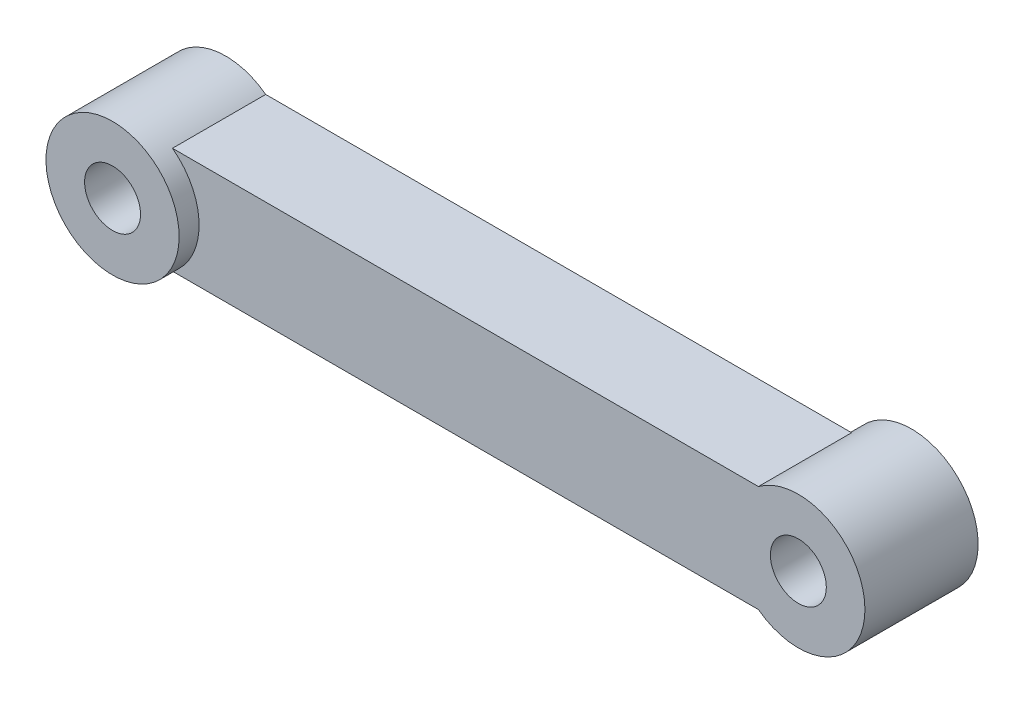
ISO-10303-21;
HEADER;
FILE_DESCRIPTION(('STEP AP214'),'2;1');
FILE_NAME('part.step','',(''),(''),'','','');
FILE_SCHEMA(('AUTOMOTIVE_DESIGN { 1 0 10303 214 1 1 1 1 }'));
ENDSEC;
DATA;
#1=APPLICATION_CONTEXT('core data for automotive mechanical design processes');
#2=APPLICATION_PROTOCOL_DEFINITION('international standard','automotive_design',2000,#1);
#3=PRODUCT_CONTEXT('',#1,'mechanical');
#4=PRODUCT('Part','Part','',(#3));
#5=PRODUCT_RELATED_PRODUCT_CATEGORY('part','',(#4));
#6=PRODUCT_DEFINITION_FORMATION('','',#4);
#7=PRODUCT_DEFINITION_CONTEXT('part definition',#1,'design');
#8=PRODUCT_DEFINITION('design','',#6,#7);
#9=PRODUCT_DEFINITION_SHAPE('','',#8);
#10=(LENGTH_UNIT() NAMED_UNIT(*) SI_UNIT(.MILLI.,.METRE.));
#11=(NAMED_UNIT(*) PLANE_ANGLE_UNIT() SI_UNIT($,.RADIAN.));
#12=(NAMED_UNIT(*) SI_UNIT($,.STERADIAN.) SOLID_ANGLE_UNIT());
#13=UNCERTAINTY_MEASURE_WITH_UNIT(LENGTH_MEASURE(1.E-05),#10,'distance_accuracy_value','');
#14=(GEOMETRIC_REPRESENTATION_CONTEXT(3) GLOBAL_UNCERTAINTY_ASSIGNED_CONTEXT((#13)) GLOBAL_UNIT_ASSIGNED_CONTEXT((#10,
#11,#12)) REPRESENTATION_CONTEXT('',''));
#15=CARTESIAN_POINT('',(0.,0.,0.));
#16=DIRECTION('',(0.,0.,1.));
#17=DIRECTION('',(1.,0.,0.));
#18=AXIS2_PLACEMENT_3D('',#15,#16,#17);
#19=CARTESIAN_POINT('',(-43.0216580109235,-1.7639320225002,7.));
#20=DIRECTION('',(0.,0.,-1.));
#21=DIRECTION('',(-1.,0.,0.));
#22=AXIS2_PLACEMENT_3D('',#19,#20,#21);
#23=CYLINDRICAL_SURFACE('',#22,5.);
#24=CARTESIAN_POINT('',(-43.0216580109235,-1.7639320225002,0.));
#25=DIRECTION('',(0.,0.,1.));
#26=DIRECTION('',(1.,0.,0.));
#27=AXIS2_PLACEMENT_3D('',#24,#25,#26);
#28=CIRCLE('',#27,5.);
#29=CARTESIAN_POINT('',(-40.0216580109235,2.23606797749981,0.));
#30=VERTEX_POINT('',#29);
#31=CARTESIAN_POINT('',(-40.0216580109235,-5.7639320225002,0.));
#32=VERTEX_POINT('',#31);
#33=EDGE_CURVE('E98',#30,#32,#28,.T.);
#34=ORIENTED_EDGE('',*,*,#33,.T.);
#35=DIRECTION('',(0.,0.,-1.));
#36=VECTOR('',#35,1.);
#37=CARTESIAN_POINT('',(-40.0216580109235,-5.7639320225002,7.));
#38=LINE('',#37,#36);
#39=CARTESIAN_POINT('',(-40.0216580109235,-5.7639320225002,7.));
#40=VERTEX_POINT('',#39);
#41=EDGE_CURVE('E51',#40,#32,#38,.T.);
#42=ORIENTED_EDGE('',*,*,#41,.F.);
#43=CARTESIAN_POINT('',(-43.0216580109235,-1.7639320225002,7.));
#44=DIRECTION('',(0.,0.,1.));
#45=DIRECTION('',(1.,0.,0.));
#46=AXIS2_PLACEMENT_3D('',#43,#44,#45);
#47=CIRCLE('',#46,5.);
#48=CARTESIAN_POINT('',(-40.0216580109235,2.23606797749981,7.));
#49=VERTEX_POINT('',#48);
#50=EDGE_CURVE('E58',#40,#49,#47,.T.);
#51=ORIENTED_EDGE('',*,*,#50,.T.);
#52=DIRECTION('',(0.,0.,-1.));
#53=VECTOR('',#52,1.);
#54=CARTESIAN_POINT('',(-40.0216580109235,2.23606797749981,7.));
#55=LINE('',#54,#53);
#56=EDGE_CURVE('E86',#49,#30,#55,.T.);
#57=ORIENTED_EDGE('',*,*,#56,.T.);
#58=EDGE_LOOP('',(#34,#42,#51,#57));
#59=FACE_BOUND('',#58,.T.);
#60=CARTESIAN_POINT('',(-43.0216580109235,-1.7639320225002,8.5));
#61=DIRECTION('',(0.,0.,1.));
#62=DIRECTION('',(1.,0.,0.));
#63=AXIS2_PLACEMENT_3D('',#60,#61,#62);
#64=CIRCLE('',#63,5.);
#65=CARTESIAN_POINT('',(-38.0216580109235,-1.7639320225002,8.5));
#66=VERTEX_POINT('',#65);
#67=EDGE_CURVE('E132',#66,#66,#64,.T.);
#68=ORIENTED_EDGE('',*,*,#67,.F.);
#69=EDGE_LOOP('',(#68));
#70=FACE_BOUND('',#69,.T.);
#71=ADVANCED_FACE('F47',(#59,#70),#23,.T.);
#72=CARTESIAN_POINT('',(0.,-5.7639320225002,7.));
#73=DIRECTION('',(0.,1.,0.));
#74=DIRECTION('',(-1.,0.,0.));
#75=AXIS2_PLACEMENT_3D('',#72,#73,#74);
#76=PLANE('',#75);
#77=DIRECTION('',(1.,0.,0.));
#78=VECTOR('',#77,1.);
#79=CARTESIAN_POINT('',(0.,-5.7639320225002,0.));
#80=LINE('',#79,#78);
#81=CARTESIAN_POINT('',(3.97834198907648,-5.7639320225002,0.));
#82=VERTEX_POINT('',#81);
#83=EDGE_CURVE('E102',#32,#82,#80,.T.);
#84=ORIENTED_EDGE('',*,*,#83,.T.);
#85=DIRECTION('',(0.,0.,-1.));
#86=VECTOR('',#85,1.);
#87=CARTESIAN_POINT('',(3.97834198907648,-5.7639320225002,7.));
#88=LINE('',#87,#86);
#89=CARTESIAN_POINT('',(3.97834198907648,-5.7639320225002,7.));
#90=VERTEX_POINT('',#89);
#91=EDGE_CURVE('E110',#90,#82,#88,.T.);
#92=ORIENTED_EDGE('',*,*,#91,.F.);
#93=DIRECTION('',(1.,0.,0.));
#94=VECTOR('',#93,1.);
#95=CARTESIAN_POINT('',(0.,-5.7639320225002,7.));
#96=LINE('',#95,#94);
#97=EDGE_CURVE('E101',#40,#90,#96,.T.);
#98=ORIENTED_EDGE('',*,*,#97,.F.);
#99=ORIENTED_EDGE('',*,*,#41,.T.);
#100=EDGE_LOOP('',(#84,#92,#98,#99));
#101=FACE_BOUND('',#100,.T.);
#102=ADVANCED_FACE('F174',(#101),#76,.F.);
#103=CARTESIAN_POINT('',(6.97834198907648,-1.7639320225002,7.));
#104=DIRECTION('',(0.,0.,-1.));
#105=DIRECTION('',(-1.,0.,0.));
#106=AXIS2_PLACEMENT_3D('',#103,#104,#105);
#107=CYLINDRICAL_SURFACE('',#106,5.);
#108=ORIENTED_EDGE('',*,*,#91,.T.);
#109=CARTESIAN_POINT('',(6.97834198907648,-1.7639320225002,0.));
#110=DIRECTION('',(0.,0.,-1.));
#111=DIRECTION('',(-1.,0.,0.));
#112=AXIS2_PLACEMENT_3D('',#109,#110,#111);
#113=CIRCLE('',#112,5.);
#114=CARTESIAN_POINT('',(3.97834198907648,2.23606797749981,0.));
#115=VERTEX_POINT('',#114);
#116=EDGE_CURVE('E11',#82,#115,#113,.T.);
#117=ORIENTED_EDGE('',*,*,#116,.T.);
#118=DIRECTION('',(0.,0.,-1.));
#119=VECTOR('',#118,1.);
#120=CARTESIAN_POINT('',(3.97834198907648,2.23606797749981,7.));
#121=LINE('',#120,#119);
#122=CARTESIAN_POINT('',(3.97834198907648,2.23606797749981,7.));
#123=VERTEX_POINT('',#122);
#124=EDGE_CURVE('E105',#123,#115,#121,.T.);
#125=ORIENTED_EDGE('',*,*,#124,.F.);
#126=CARTESIAN_POINT('',(6.97834198907648,-1.7639320225002,7.));
#127=DIRECTION('',(0.,0.,1.));
#128=DIRECTION('',(1.,0.,0.));
#129=AXIS2_PLACEMENT_3D('',#126,#127,#128);
#130=CIRCLE('',#129,5.);
#131=EDGE_CURVE('E67',#90,#123,#130,.T.);
#132=ORIENTED_EDGE('',*,*,#131,.F.);
#133=EDGE_LOOP('',(#108,#117,#125,#132));
#134=FACE_BOUND('',#133,.T.);
#135=CARTESIAN_POINT('',(6.97834198907648,-1.7639320225002,-1.5));
#136=DIRECTION('',(0.,0.,-1.));
#137=DIRECTION('',(-1.,0.,0.));
#138=AXIS2_PLACEMENT_3D('',#135,#136,#137);
#139=CIRCLE('',#138,5.);
#140=CARTESIAN_POINT('',(1.97834198907648,-1.7639320225002,-1.5));
#141=VERTEX_POINT('',#140);
#142=EDGE_CURVE('E150',#141,#141,#139,.T.);
#143=ORIENTED_EDGE('',*,*,#142,.F.);
#144=EDGE_LOOP('',(#143));
#145=FACE_BOUND('',#144,.T.);
#146=ADVANCED_FACE('F113',(#134,#145),#107,.T.);
#147=CARTESIAN_POINT('',(0.,2.23606797749981,7.));
#148=DIRECTION('',(0.,1.,0.));
#149=DIRECTION('',(-1.,0.,0.));
#150=AXIS2_PLACEMENT_3D('',#147,#148,#149);
#151=PLANE('',#150);
#152=DIRECTION('',(1.,0.,0.));
#153=VECTOR('',#152,1.);
#154=CARTESIAN_POINT('',(0.,2.23606797749981,0.));
#155=LINE('',#154,#153);
#156=EDGE_CURVE('E94',#30,#115,#155,.T.);
#157=ORIENTED_EDGE('',*,*,#156,.F.);
#158=ORIENTED_EDGE('',*,*,#56,.F.);
#159=DIRECTION('',(1.,0.,0.));
#160=VECTOR('',#159,1.);
#161=CARTESIAN_POINT('',(0.,2.23606797749981,7.));
#162=LINE('',#161,#160);
#163=EDGE_CURVE('E107',#49,#123,#162,.T.);
#164=ORIENTED_EDGE('',*,*,#163,.T.);
#165=ORIENTED_EDGE('',*,*,#124,.T.);
#166=EDGE_LOOP('',(#157,#158,#164,#165));
#167=FACE_BOUND('',#166,.T.);
#168=ADVANCED_FACE('F106',(#167),#151,.T.);
#169=CARTESIAN_POINT('',(-43.0216580109235,-1.7639320225002,7.));
#170=DIRECTION('',(0.,0.,-1.));
#171=DIRECTION('',(-1.,0.,0.));
#172=AXIS2_PLACEMENT_3D('',#169,#170,#171);
#173=CYLINDRICAL_SURFACE('',#172,2.1);
#174=CARTESIAN_POINT('',(-43.0216580109235,-1.7639320225002,0.));
#175=DIRECTION('',(0.,0.,1.));
#176=DIRECTION('',(1.,0.,0.));
#177=AXIS2_PLACEMENT_3D('',#174,#175,#176);
#178=CIRCLE('',#177,2.1);
#179=CARTESIAN_POINT('',(-40.9216580109235,-1.7639320225002,0.));
#180=VERTEX_POINT('',#179);
#181=EDGE_CURVE('E128',#180,#180,#178,.T.);
#182=ORIENTED_EDGE('',*,*,#181,.F.);
#183=EDGE_LOOP('',(#182));
#184=FACE_BOUND('',#183,.T.);
#185=CARTESIAN_POINT('',(-43.0216580109235,-1.7639320225002,8.5));
#186=DIRECTION('',(0.,0.,1.));
#187=DIRECTION('',(1.,0.,0.));
#188=AXIS2_PLACEMENT_3D('',#185,#186,#187);
#189=CIRCLE('',#188,2.1);
#190=CARTESIAN_POINT('',(-40.9216580109235,-1.7639320225002,8.5));
#191=VERTEX_POINT('',#190);
#192=EDGE_CURVE('E147',#191,#191,#189,.T.);
#193=ORIENTED_EDGE('',*,*,#192,.T.);
#194=EDGE_LOOP('',(#193));
#195=FACE_BOUND('',#194,.T.);
#196=ADVANCED_FACE('F49',(#184,#195),#173,.F.);
#197=CARTESIAN_POINT('',(6.97834198907648,-1.7639320225002,7.));
#198=DIRECTION('',(0.,0.,-1.));
#199=DIRECTION('',(-1.,0.,0.));
#200=AXIS2_PLACEMENT_3D('',#197,#198,#199);
#201=CYLINDRICAL_SURFACE('',#200,2.1);
#202=CARTESIAN_POINT('',(6.97834198907648,-1.7639320225002,7.));
#203=DIRECTION('',(0.,0.,1.));
#204=DIRECTION('',(1.,0.,0.));
#205=AXIS2_PLACEMENT_3D('',#202,#203,#204);
#206=CIRCLE('',#205,2.1);
#207=CARTESIAN_POINT('',(9.07834198907648,-1.7639320225002,7.));
#208=VERTEX_POINT('',#207);
#209=EDGE_CURVE('E122',#208,#208,#206,.T.);
#210=ORIENTED_EDGE('',*,*,#209,.T.);
#211=EDGE_LOOP('',(#210));
#212=FACE_BOUND('',#211,.T.);
#213=CARTESIAN_POINT('',(6.97834198907648,-1.7639320225002,-1.5));
#214=DIRECTION('',(0.,0.,-1.));
#215=DIRECTION('',(-1.,0.,0.));
#216=AXIS2_PLACEMENT_3D('',#213,#214,#215);
#217=CIRCLE('',#216,2.1);
#218=CARTESIAN_POINT('',(4.87834198907648,-1.7639320225002,-1.5));
#219=VERTEX_POINT('',#218);
#220=EDGE_CURVE('E155',#219,#219,#217,.T.);
#221=ORIENTED_EDGE('',*,*,#220,.T.);
#222=EDGE_LOOP('',(#221));
#223=FACE_BOUND('',#222,.T.);
#224=ADVANCED_FACE('F160',(#212,#223),#201,.F.);
#225=CARTESIAN_POINT('',(0.,0.,7.));
#226=DIRECTION('',(0.,0.,1.));
#227=DIRECTION('',(1.,0.,0.));
#228=AXIS2_PLACEMENT_3D('',#225,#226,#227);
#229=PLANE('',#228);
#230=ORIENTED_EDGE('',*,*,#50,.F.);
#231=ORIENTED_EDGE('',*,*,#97,.T.);
#232=ORIENTED_EDGE('',*,*,#131,.T.);
#233=ORIENTED_EDGE('',*,*,#163,.F.);
#234=EDGE_LOOP('',(#230,#231,#232,#233));
#235=FACE_BOUND('',#234,.T.);
#236=ORIENTED_EDGE('',*,*,#209,.F.);
#237=EDGE_LOOP('',(#236));
#238=FACE_BOUND('',#237,.T.);
#239=ADVANCED_FACE('F188',(#235,#238),#229,.T.);
#240=CARTESIAN_POINT('',(0.,0.,0.));
#241=DIRECTION('',(0.,0.,1.));
#242=DIRECTION('',(1.,0.,0.));
#243=AXIS2_PLACEMENT_3D('',#240,#241,#242);
#244=PLANE('',#243);
#245=ORIENTED_EDGE('',*,*,#116,.F.);
#246=ORIENTED_EDGE('',*,*,#83,.F.);
#247=ORIENTED_EDGE('',*,*,#33,.F.);
#248=ORIENTED_EDGE('',*,*,#156,.T.);
#249=EDGE_LOOP('',(#245,#246,#247,#248));
#250=FACE_BOUND('',#249,.T.);
#251=ORIENTED_EDGE('',*,*,#181,.T.);
#252=EDGE_LOOP('',(#251));
#253=FACE_BOUND('',#252,.T.);
#254=ADVANCED_FACE('F96',(#250,#253),#244,.F.);
#255=CARTESIAN_POINT('',(-43.0216580109235,-1.7639320225002,8.5));
#256=DIRECTION('',(0.,0.,1.));
#257=DIRECTION('',(1.,0.,0.));
#258=AXIS2_PLACEMENT_3D('',#255,#256,#257);
#259=PLANE('',#258);
#260=ORIENTED_EDGE('',*,*,#67,.T.);
#261=EDGE_LOOP('',(#260));
#262=FACE_BOUND('',#261,.T.);
#263=ORIENTED_EDGE('',*,*,#192,.F.);
#264=EDGE_LOOP('',(#263));
#265=FACE_BOUND('',#264,.T.);
#266=ADVANCED_FACE('F164',(#262,#265),#259,.T.);
#267=CARTESIAN_POINT('',(6.97834198907648,-1.7639320225002,-1.5));
#268=DIRECTION('',(0.,0.,-1.));
#269=DIRECTION('',(-1.,0.,0.));
#270=AXIS2_PLACEMENT_3D('',#267,#268,#269);
#271=PLANE('',#270);
#272=ORIENTED_EDGE('',*,*,#142,.T.);
#273=EDGE_LOOP('',(#272));
#274=FACE_BOUND('',#273,.T.);
#275=ORIENTED_EDGE('',*,*,#220,.F.);
#276=EDGE_LOOP('',(#275));
#277=FACE_BOUND('',#276,.T.);
#278=ADVANCED_FACE('F162',(#274,#277),#271,.T.);
#279=CLOSED_SHELL('',(#71,#102,#146,#168,#196,#224,#239,#254,#266,#278));
#280=MANIFOLD_SOLID_BREP('B2',#279);
#281=ADVANCED_BREP_SHAPE_REPRESENTATION('',(#18,#280),#14);
#282=SHAPE_DEFINITION_REPRESENTATION(#9,#281);
ENDSEC;
END-ISO-10303-21;
